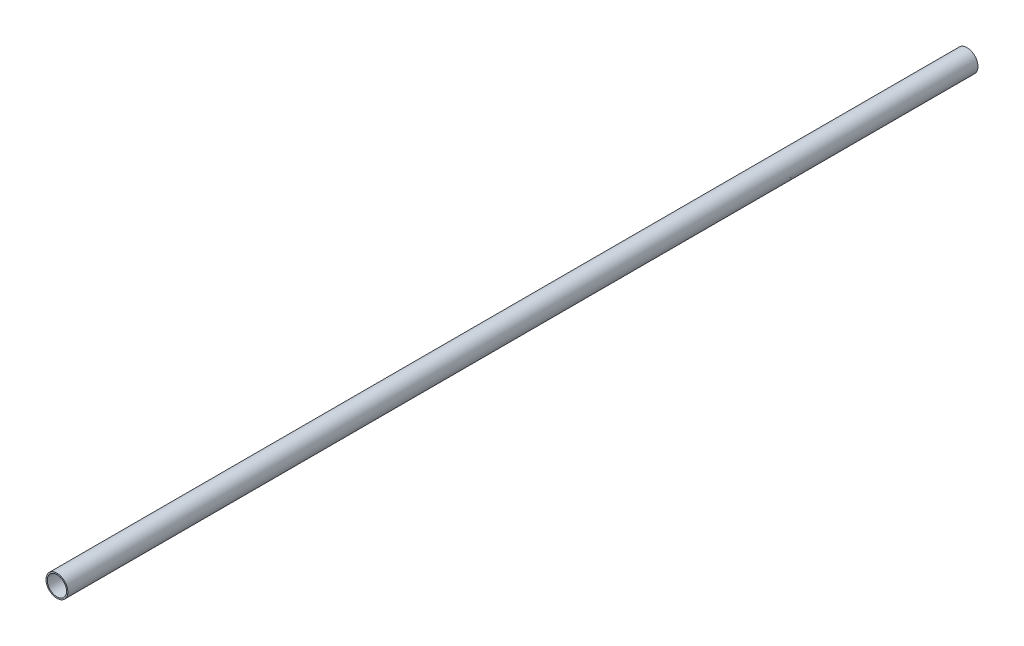
ISO-10303-21;
HEADER;
FILE_DESCRIPTION(('STEP AP214'),'2;1');
FILE_NAME('part.step','',(''),(''),'','','');
FILE_SCHEMA(('AUTOMOTIVE_DESIGN { 1 0 10303 214 1 1 1 1 }'));
ENDSEC;
DATA;
#1=APPLICATION_CONTEXT('core data for automotive mechanical design processes');
#2=APPLICATION_PROTOCOL_DEFINITION('international standard','automotive_design',2000,#1);
#3=PRODUCT_CONTEXT('',#1,'mechanical');
#4=PRODUCT('Part','Part','',(#3));
#5=PRODUCT_RELATED_PRODUCT_CATEGORY('part','',(#4));
#6=PRODUCT_DEFINITION_FORMATION('','',#4);
#7=PRODUCT_DEFINITION_CONTEXT('part definition',#1,'design');
#8=PRODUCT_DEFINITION('design','',#6,#7);
#9=PRODUCT_DEFINITION_SHAPE('','',#8);
#10=(LENGTH_UNIT() NAMED_UNIT(*) SI_UNIT(.MILLI.,.METRE.));
#11=(NAMED_UNIT(*) PLANE_ANGLE_UNIT() SI_UNIT($,.RADIAN.));
#12=(NAMED_UNIT(*) SI_UNIT($,.STERADIAN.) SOLID_ANGLE_UNIT());
#13=UNCERTAINTY_MEASURE_WITH_UNIT(LENGTH_MEASURE(1.E-05),#10,'distance_accuracy_value','');
#14=(GEOMETRIC_REPRESENTATION_CONTEXT(3) GLOBAL_UNCERTAINTY_ASSIGNED_CONTEXT((#13)) GLOBAL_UNIT_ASSIGNED_CONTEXT((#10,
#11,#12)) REPRESENTATION_CONTEXT('',''));
#15=CARTESIAN_POINT('',(0.,0.,0.));
#16=DIRECTION('',(0.,0.,1.));
#17=DIRECTION('',(1.,0.,0.));
#18=AXIS2_PLACEMENT_3D('',#15,#16,#17);
#19=CARTESIAN_POINT('',(0.,719.,-3240.));
#20=DIRECTION('',(0.,0.,1.));
#21=DIRECTION('',(1.,0.,0.));
#22=AXIS2_PLACEMENT_3D('',#19,#20,#21);
#23=CYLINDRICAL_SURFACE('',#22,12.5);
#24=CARTESIAN_POINT('',(0.,719.,-2140.));
#25=DIRECTION('',(0.,0.,-1.));
#26=DIRECTION('',(-1.,0.,0.));
#27=AXIS2_PLACEMENT_3D('',#24,#25,#26);
#28=CIRCLE('',#27,12.5);
#29=CARTESIAN_POINT('',(-12.5,719.,-2140.));
#30=VERTEX_POINT('',#29);
#31=EDGE_CURVE('E50',#30,#30,#28,.T.);
#32=ORIENTED_EDGE('',*,*,#31,.F.);
#33=EDGE_LOOP('',(#32));
#34=FACE_BOUND('',#33,.T.);
#35=CARTESIAN_POINT('',(0.,719.,-1100.));
#36=DIRECTION('',(0.,0.,1.));
#37=DIRECTION('',(1.,0.,0.));
#38=AXIS2_PLACEMENT_3D('',#35,#36,#37);
#39=CIRCLE('',#38,12.5);
#40=CARTESIAN_POINT('',(12.5,719.,-1100.));
#41=VERTEX_POINT('',#40);
#42=EDGE_CURVE('E48',#41,#41,#39,.T.);
#43=ORIENTED_EDGE('',*,*,#42,.F.);
#44=EDGE_LOOP('',(#43));
#45=FACE_BOUND('',#44,.T.);
#46=ADVANCED_FACE('F37',(#34,#45),#23,.T.);
#47=CARTESIAN_POINT('',(-15.5,0.,-2140.));
#48=DIRECTION('',(0.,0.,-1.));
#49=DIRECTION('',(-1.,0.,0.));
#50=AXIS2_PLACEMENT_3D('',#47,#48,#49);
#51=PLANE('',#50);
#52=CARTESIAN_POINT('',(0.,719.,-2140.));
#53=DIRECTION('',(0.,0.,-1.));
#54=DIRECTION('',(-1.,0.,0.));
#55=AXIS2_PLACEMENT_3D('',#52,#53,#54);
#56=CIRCLE('',#55,11.);
#57=CARTESIAN_POINT('',(-11.,719.,-2140.));
#58=VERTEX_POINT('',#57);
#59=EDGE_CURVE('E41',#58,#58,#56,.T.);
#60=ORIENTED_EDGE('',*,*,#59,.F.);
#61=EDGE_LOOP('',(#60));
#62=FACE_BOUND('',#61,.T.);
#63=ORIENTED_EDGE('',*,*,#31,.T.);
#64=EDGE_LOOP('',(#63));
#65=FACE_BOUND('',#64,.T.);
#66=ADVANCED_FACE('F59',(#62,#65),#51,.T.);
#67=CARTESIAN_POINT('',(-15.5,0.,-1100.));
#68=DIRECTION('',(0.,0.,1.));
#69=DIRECTION('',(1.,0.,0.));
#70=AXIS2_PLACEMENT_3D('',#67,#68,#69);
#71=PLANE('',#70);
#72=CARTESIAN_POINT('',(0.,719.,-1100.));
#73=DIRECTION('',(0.,0.,1.));
#74=DIRECTION('',(1.,0.,0.));
#75=AXIS2_PLACEMENT_3D('',#72,#73,#74);
#76=CIRCLE('',#75,11.);
#77=CARTESIAN_POINT('',(11.,719.,-1100.));
#78=VERTEX_POINT('',#77);
#79=EDGE_CURVE('E10',#78,#78,#76,.T.);
#80=ORIENTED_EDGE('',*,*,#79,.F.);
#81=EDGE_LOOP('',(#80));
#82=FACE_BOUND('',#81,.T.);
#83=ORIENTED_EDGE('',*,*,#42,.T.);
#84=EDGE_LOOP('',(#83));
#85=FACE_BOUND('',#84,.T.);
#86=ADVANCED_FACE('F56',(#82,#85),#71,.T.);
#87=CARTESIAN_POINT('',(0.,719.,-3240.));
#88=DIRECTION('',(0.,0.,1.));
#89=DIRECTION('',(1.,0.,0.));
#90=AXIS2_PLACEMENT_3D('',#87,#88,#89);
#91=CYLINDRICAL_SURFACE('',#90,11.);
#92=ORIENTED_EDGE('',*,*,#59,.T.);
#93=EDGE_LOOP('',(#92));
#94=FACE_BOUND('',#93,.T.);
#95=ORIENTED_EDGE('',*,*,#79,.T.);
#96=EDGE_LOOP('',(#95));
#97=FACE_BOUND('',#96,.T.);
#98=ADVANCED_FACE('F39',(#94,#97),#91,.F.);
#99=CLOSED_SHELL('',(#46,#66,#86,#98));
#100=MANIFOLD_SOLID_BREP('B2',#99);
#101=ADVANCED_BREP_SHAPE_REPRESENTATION('',(#18,#100),#14);
#102=SHAPE_DEFINITION_REPRESENTATION(#9,#101);
ENDSEC;
END-ISO-10303-21;
